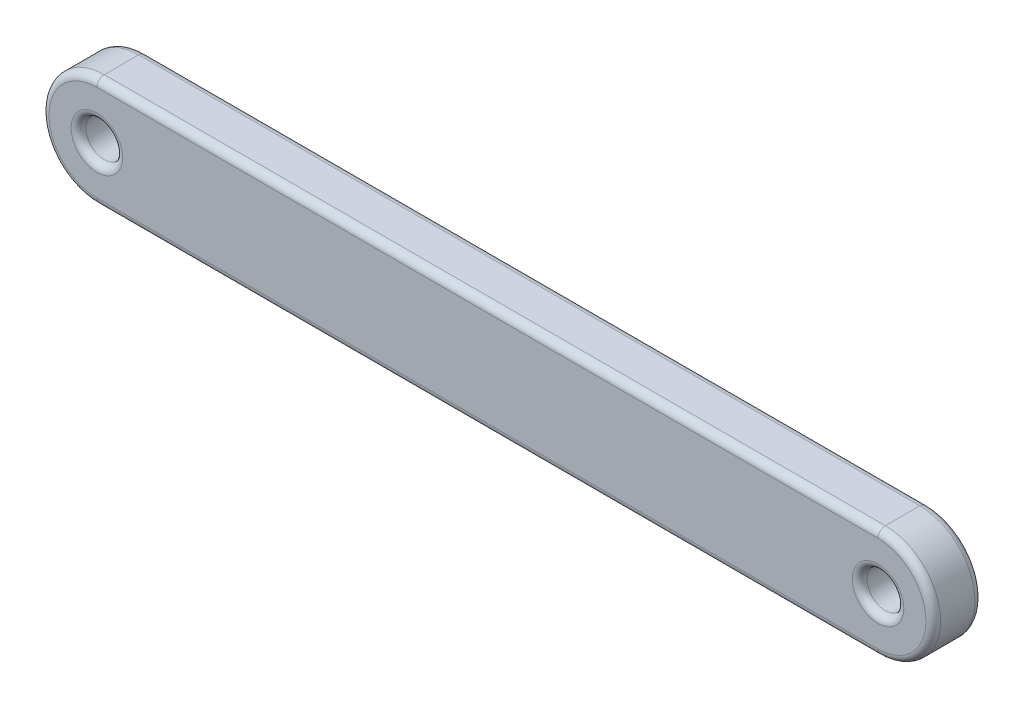
ISO-10303-21;
HEADER;
FILE_DESCRIPTION(('STEP AP214'),'2;1');
FILE_NAME('part.step','',(''),(''),'','','');
FILE_SCHEMA(('AUTOMOTIVE_DESIGN { 1 0 10303 214 1 1 1 1 }'));
ENDSEC;
DATA;
#1=APPLICATION_CONTEXT('core data for automotive mechanical design processes');
#2=APPLICATION_PROTOCOL_DEFINITION('international standard','automotive_design',2000,#1);
#3=PRODUCT_CONTEXT('',#1,'mechanical');
#4=PRODUCT('Part','Part','',(#3));
#5=PRODUCT_RELATED_PRODUCT_CATEGORY('part','',(#4));
#6=PRODUCT_DEFINITION_FORMATION('','',#4);
#7=PRODUCT_DEFINITION_CONTEXT('part definition',#1,'design');
#8=PRODUCT_DEFINITION('design','',#6,#7);
#9=PRODUCT_DEFINITION_SHAPE('','',#8);
#10=(LENGTH_UNIT() NAMED_UNIT(*) SI_UNIT(.MILLI.,.METRE.));
#11=(NAMED_UNIT(*) PLANE_ANGLE_UNIT() SI_UNIT($,.RADIAN.));
#12=(NAMED_UNIT(*) SI_UNIT($,.STERADIAN.) SOLID_ANGLE_UNIT());
#13=UNCERTAINTY_MEASURE_WITH_UNIT(LENGTH_MEASURE(1.E-05),#10,'distance_accuracy_value','');
#14=(GEOMETRIC_REPRESENTATION_CONTEXT(3) GLOBAL_UNCERTAINTY_ASSIGNED_CONTEXT((#13)) GLOBAL_UNIT_ASSIGNED_CONTEXT((#10,
#11,#12)) REPRESENTATION_CONTEXT('',''));
#15=CARTESIAN_POINT('',(0.,0.,0.));
#16=DIRECTION('',(0.,0.,1.));
#17=DIRECTION('',(1.,0.,0.));
#18=AXIS2_PLACEMENT_3D('',#15,#16,#17);
#19=CARTESIAN_POINT('',(0.,0.,2.));
#20=DIRECTION('',(0.,0.,1.));
#21=DIRECTION('',(1.,0.,0.));
#22=AXIS2_PLACEMENT_3D('',#19,#20,#21);
#23=PLANE('',#22);
#24=CARTESIAN_POINT('',(31.82825623,0.,2.));
#25=DIRECTION('',(0.,0.,1.));
#26=DIRECTION('',(1.,0.,0.));
#27=AXIS2_PLACEMENT_3D('',#24,#25,#26);
#28=CIRCLE('',#27,1.05);
#29=CARTESIAN_POINT('',(32.87825623,0.,2.));
#30=VERTEX_POINT('',#29);
#31=EDGE_CURVE('E11',#30,#30,#28,.F.);
#32=ORIENTED_EDGE('',*,*,#31,.T.);
#33=EDGE_LOOP('',(#32));
#34=FACE_BOUND('',#33,.T.);
#35=CARTESIAN_POINT('',(31.82825623,0.,2.));
#36=DIRECTION('',(0.,0.,1.));
#37=DIRECTION('',(1.,0.,0.));
#38=AXIS2_PLACEMENT_3D('',#35,#36,#37);
#39=CIRCLE('',#38,1.95);
#40=CARTESIAN_POINT('',(31.82825623,-1.95,2.));
#41=VERTEX_POINT('',#40);
#42=CARTESIAN_POINT('',(31.82825623,1.95,2.));
#43=VERTEX_POINT('',#42);
#44=EDGE_CURVE('E50',#41,#43,#39,.T.);
#45=ORIENTED_EDGE('',*,*,#44,.T.);
#46=DIRECTION('',(-1.,0.,0.));
#47=VECTOR('',#46,1.);
#48=CARTESIAN_POINT('',(0.,1.95,2.));
#49=LINE('',#48,#47);
#50=CARTESIAN_POINT('',(0.,1.95,2.));
#51=VERTEX_POINT('',#50);
#52=EDGE_CURVE('E42',#43,#51,#49,.T.);
#53=ORIENTED_EDGE('',*,*,#52,.T.);
#54=CARTESIAN_POINT('',(0.,0.,2.));
#55=DIRECTION('',(0.,0.,1.));
#56=DIRECTION('',(1.,0.,0.));
#57=AXIS2_PLACEMENT_3D('',#54,#55,#56);
#58=CIRCLE('',#57,1.95);
#59=CARTESIAN_POINT('',(0.,-1.95,2.));
#60=VERTEX_POINT('',#59);
#61=EDGE_CURVE('E168',#51,#60,#58,.T.);
#62=ORIENTED_EDGE('',*,*,#61,.T.);
#63=DIRECTION('',(1.,0.,0.));
#64=VECTOR('',#63,1.);
#65=CARTESIAN_POINT('',(31.82825623,-1.95,2.));
#66=LINE('',#65,#64);
#67=EDGE_CURVE('E55',#60,#41,#66,.T.);
#68=ORIENTED_EDGE('',*,*,#67,.T.);
#69=EDGE_LOOP('',(#45,#53,#62,#68));
#70=FACE_BOUND('',#69,.T.);
#71=CARTESIAN_POINT('',(0.,0.,2.));
#72=DIRECTION('',(0.,0.,1.));
#73=DIRECTION('',(1.,0.,0.));
#74=AXIS2_PLACEMENT_3D('',#71,#72,#73);
#75=CIRCLE('',#74,1.05);
#76=CARTESIAN_POINT('',(1.05,0.,2.));
#77=VERTEX_POINT('',#76);
#78=EDGE_CURVE('E165',#77,#77,#75,.F.);
#79=ORIENTED_EDGE('',*,*,#78,.T.);
#80=EDGE_LOOP('',(#79));
#81=FACE_BOUND('',#80,.T.);
#82=ADVANCED_FACE('F33',(#34,#70,#81),#23,.T.);
#83=CARTESIAN_POINT('',(0.,0.,0.));
#84=DIRECTION('',(0.,0.,1.));
#85=DIRECTION('',(1.,0.,0.));
#86=AXIS2_PLACEMENT_3D('',#83,#84,#85);
#87=PLANE('',#86);
#88=CARTESIAN_POINT('',(31.82825623,0.,0.));
#89=DIRECTION('',(0.,0.,1.));
#90=DIRECTION('',(1.,0.,0.));
#91=AXIS2_PLACEMENT_3D('',#88,#89,#90);
#92=CIRCLE('',#91,1.05);
#93=CARTESIAN_POINT('',(32.87825623,0.,0.));
#94=VERTEX_POINT('',#93);
#95=EDGE_CURVE('E130',#94,#94,#92,.T.);
#96=ORIENTED_EDGE('',*,*,#95,.T.);
#97=EDGE_LOOP('',(#96));
#98=FACE_BOUND('',#97,.T.);
#99=CARTESIAN_POINT('',(0.,0.,0.));
#100=DIRECTION('',(0.,0.,1.));
#101=DIRECTION('',(1.,0.,0.));
#102=AXIS2_PLACEMENT_3D('',#99,#100,#101);
#103=CIRCLE('',#102,1.05);
#104=CARTESIAN_POINT('',(1.05,0.,0.));
#105=VERTEX_POINT('',#104);
#106=EDGE_CURVE('E127',#105,#105,#103,.T.);
#107=ORIENTED_EDGE('',*,*,#106,.T.);
#108=EDGE_LOOP('',(#107));
#109=FACE_BOUND('',#108,.T.);
#110=CARTESIAN_POINT('',(31.82825623,0.,0.));
#111=DIRECTION('',(0.,0.,1.));
#112=DIRECTION('',(1.,0.,0.));
#113=AXIS2_PLACEMENT_3D('',#110,#111,#112);
#114=CIRCLE('',#113,1.95);
#115=CARTESIAN_POINT('',(31.82825623,1.95,0.));
#116=VERTEX_POINT('',#115);
#117=CARTESIAN_POINT('',(31.82825623,-1.95,0.));
#118=VERTEX_POINT('',#117);
#119=EDGE_CURVE('E126',#116,#118,#114,.F.);
#120=ORIENTED_EDGE('',*,*,#119,.T.);
#121=DIRECTION('',(1.,0.,0.));
#122=VECTOR('',#121,1.);
#123=CARTESIAN_POINT('',(0.,-1.95,0.));
#124=LINE('',#123,#122);
#125=CARTESIAN_POINT('',(0.,-1.95,0.));
#126=VERTEX_POINT('',#125);
#127=EDGE_CURVE('E105',#118,#126,#124,.F.);
#128=ORIENTED_EDGE('',*,*,#127,.T.);
#129=CARTESIAN_POINT('',(0.,0.,0.));
#130=DIRECTION('',(0.,0.,1.));
#131=DIRECTION('',(1.,0.,0.));
#132=AXIS2_PLACEMENT_3D('',#129,#130,#131);
#133=CIRCLE('',#132,1.95);
#134=CARTESIAN_POINT('',(0.,1.95,0.));
#135=VERTEX_POINT('',#134);
#136=EDGE_CURVE('E115',#126,#135,#133,.F.);
#137=ORIENTED_EDGE('',*,*,#136,.T.);
#138=DIRECTION('',(-1.,0.,0.));
#139=VECTOR('',#138,1.);
#140=CARTESIAN_POINT('',(0.,1.95,0.));
#141=LINE('',#140,#139);
#142=EDGE_CURVE('E121',#135,#116,#141,.F.);
#143=ORIENTED_EDGE('',*,*,#142,.T.);
#144=EDGE_LOOP('',(#120,#128,#137,#143));
#145=FACE_BOUND('',#144,.T.);
#146=ADVANCED_FACE('F124',(#98,#109,#145),#87,.F.);
#147=CARTESIAN_POINT('',(0.,0.,2.));
#148=DIRECTION('',(0.,0.,-1.));
#149=DIRECTION('',(-1.,0.,0.));
#150=AXIS2_PLACEMENT_3D('',#147,#148,#149);
#151=CYLINDRICAL_SURFACE('',#150,2.25);
#152=DIRECTION('',(0.,0.,-1.));
#153=VECTOR('',#152,1.);
#154=CARTESIAN_POINT('',(0.,2.25,2.));
#155=LINE('',#154,#153);
#156=CARTESIAN_POINT('',(0.,2.25,1.7));
#157=VERTEX_POINT('',#156);
#158=CARTESIAN_POINT('',(0.,2.25,0.3));
#159=VERTEX_POINT('',#158);
#160=EDGE_CURVE('E177',#157,#159,#155,.T.);
#161=ORIENTED_EDGE('',*,*,#160,.T.);
#162=CARTESIAN_POINT('',(0.,0.,0.3));
#163=DIRECTION('',(0.,0.,1.));
#164=DIRECTION('',(1.,0.,0.));
#165=AXIS2_PLACEMENT_3D('',#162,#163,#164);
#166=CIRCLE('',#165,2.25);
#167=CARTESIAN_POINT('',(0.,-2.25,0.3));
#168=VERTEX_POINT('',#167);
#169=EDGE_CURVE('E163',#159,#168,#166,.T.);
#170=ORIENTED_EDGE('',*,*,#169,.T.);
#171=DIRECTION('',(0.,0.,-1.));
#172=VECTOR('',#171,1.);
#173=CARTESIAN_POINT('',(0.,-2.25,2.));
#174=LINE('',#173,#172);
#175=CARTESIAN_POINT('',(0.,-2.25,1.7));
#176=VERTEX_POINT('',#175);
#177=EDGE_CURVE('E122',#176,#168,#174,.T.);
#178=ORIENTED_EDGE('',*,*,#177,.F.);
#179=CARTESIAN_POINT('',(0.,0.,1.7));
#180=DIRECTION('',(0.,0.,1.));
#181=DIRECTION('',(1.,0.,0.));
#182=AXIS2_PLACEMENT_3D('',#179,#180,#181);
#183=CIRCLE('',#182,2.25);
#184=EDGE_CURVE('E161',#176,#157,#183,.F.);
#185=ORIENTED_EDGE('',*,*,#184,.T.);
#186=EDGE_LOOP('',(#161,#170,#178,#185));
#187=FACE_BOUND('',#186,.T.);
#188=ADVANCED_FACE('F203',(#187),#151,.T.);
#189=CARTESIAN_POINT('',(0.,-2.25,2.));
#190=DIRECTION('',(0.,1.,0.));
#191=DIRECTION('',(0.,0.,1.));
#192=AXIS2_PLACEMENT_3D('',#189,#190,#191);
#193=PLANE('',#192);
#194=ORIENTED_EDGE('',*,*,#177,.T.);
#195=DIRECTION('',(1.,0.,0.));
#196=VECTOR('',#195,1.);
#197=CARTESIAN_POINT('',(0.,-2.25,0.3));
#198=LINE('',#197,#196);
#199=CARTESIAN_POINT('',(31.82825623,-2.25,0.3));
#200=VERTEX_POINT('',#199);
#201=EDGE_CURVE('E108',#168,#200,#198,.T.);
#202=ORIENTED_EDGE('',*,*,#201,.T.);
#203=DIRECTION('',(0.,0.,-1.));
#204=VECTOR('',#203,1.);
#205=CARTESIAN_POINT('',(31.82825623,-2.25,2.));
#206=LINE('',#205,#204);
#207=CARTESIAN_POINT('',(31.82825623,-2.25,1.7));
#208=VERTEX_POINT('',#207);
#209=EDGE_CURVE('E200',#208,#200,#206,.T.);
#210=ORIENTED_EDGE('',*,*,#209,.F.);
#211=DIRECTION('',(1.,0.,0.));
#212=VECTOR('',#211,1.);
#213=CARTESIAN_POINT('',(0.,-2.25,1.7));
#214=LINE('',#213,#212);
#215=EDGE_CURVE('E149',#208,#176,#214,.F.);
#216=ORIENTED_EDGE('',*,*,#215,.T.);
#217=EDGE_LOOP('',(#194,#202,#210,#216));
#218=FACE_BOUND('',#217,.T.);
#219=ADVANCED_FACE('F198',(#218),#193,.F.);
#220=CARTESIAN_POINT('',(31.82825623,0.,2.));
#221=DIRECTION('',(0.,0.,-1.));
#222=DIRECTION('',(-1.,0.,0.));
#223=AXIS2_PLACEMENT_3D('',#220,#221,#222);
#224=CYLINDRICAL_SURFACE('',#223,2.25);
#225=ORIENTED_EDGE('',*,*,#209,.T.);
#226=CARTESIAN_POINT('',(31.82825623,0.,0.3));
#227=DIRECTION('',(0.,0.,1.));
#228=DIRECTION('',(1.,0.,0.));
#229=AXIS2_PLACEMENT_3D('',#226,#227,#228);
#230=CIRCLE('',#229,2.25);
#231=CARTESIAN_POINT('',(31.82825623,2.25,0.3));
#232=VERTEX_POINT('',#231);
#233=EDGE_CURVE('E154',#200,#232,#230,.T.);
#234=ORIENTED_EDGE('',*,*,#233,.T.);
#235=DIRECTION('',(0.,0.,-1.));
#236=VECTOR('',#235,1.);
#237=CARTESIAN_POINT('',(31.82825623,2.25,2.));
#238=LINE('',#237,#236);
#239=CARTESIAN_POINT('',(31.82825623,2.25,1.7));
#240=VERTEX_POINT('',#239);
#241=EDGE_CURVE('E206',#240,#232,#238,.T.);
#242=ORIENTED_EDGE('',*,*,#241,.F.);
#243=CARTESIAN_POINT('',(31.82825623,0.,1.7));
#244=DIRECTION('',(0.,0.,1.));
#245=DIRECTION('',(1.,0.,0.));
#246=AXIS2_PLACEMENT_3D('',#243,#244,#245);
#247=CIRCLE('',#246,2.25);
#248=EDGE_CURVE('E152',#240,#208,#247,.F.);
#249=ORIENTED_EDGE('',*,*,#248,.T.);
#250=EDGE_LOOP('',(#225,#234,#242,#249));
#251=FACE_BOUND('',#250,.T.);
#252=ADVANCED_FACE('F219',(#251),#224,.T.);
#253=CARTESIAN_POINT('',(0.,2.25,2.));
#254=DIRECTION('',(0.,-1.,0.));
#255=DIRECTION('',(0.,0.,-1.));
#256=AXIS2_PLACEMENT_3D('',#253,#254,#255);
#257=PLANE('',#256);
#258=ORIENTED_EDGE('',*,*,#241,.T.);
#259=DIRECTION('',(-1.,0.,0.));
#260=VECTOR('',#259,1.);
#261=CARTESIAN_POINT('',(0.,2.25,0.3));
#262=LINE('',#261,#260);
#263=EDGE_CURVE('E159',#232,#159,#262,.T.);
#264=ORIENTED_EDGE('',*,*,#263,.T.);
#265=ORIENTED_EDGE('',*,*,#160,.F.);
#266=DIRECTION('',(-1.,0.,0.));
#267=VECTOR('',#266,1.);
#268=CARTESIAN_POINT('',(31.82825623,2.25,1.7));
#269=LINE('',#268,#267);
#270=EDGE_CURVE('E156',#157,#240,#269,.F.);
#271=ORIENTED_EDGE('',*,*,#270,.T.);
#272=EDGE_LOOP('',(#258,#264,#265,#271));
#273=FACE_BOUND('',#272,.T.);
#274=ADVANCED_FACE('F223',(#273),#257,.F.);
#275=CARTESIAN_POINT('',(0.,0.,2.));
#276=DIRECTION('',(0.,0.,-1.));
#277=DIRECTION('',(-1.,0.,0.));
#278=AXIS2_PLACEMENT_3D('',#275,#276,#277);
#279=CYLINDRICAL_SURFACE('',#278,0.75);
#280=CARTESIAN_POINT('',(0.,0.,0.3));
#281=DIRECTION('',(0.,0.,1.));
#282=DIRECTION('',(1.,0.,0.));
#283=AXIS2_PLACEMENT_3D('',#280,#281,#282);
#284=CIRCLE('',#283,0.75);
#285=CARTESIAN_POINT('',(0.75,0.,0.3));
#286=VERTEX_POINT('',#285);
#287=EDGE_CURVE('E146',#286,#286,#284,.F.);
#288=ORIENTED_EDGE('',*,*,#287,.T.);
#289=EDGE_LOOP('',(#288));
#290=FACE_BOUND('',#289,.T.);
#291=CARTESIAN_POINT('',(0.,0.,1.7));
#292=DIRECTION('',(0.,0.,1.));
#293=DIRECTION('',(1.,0.,0.));
#294=AXIS2_PLACEMENT_3D('',#291,#292,#293);
#295=CIRCLE('',#294,0.75);
#296=CARTESIAN_POINT('',(0.75,0.,1.7));
#297=VERTEX_POINT('',#296);
#298=EDGE_CURVE('E143',#297,#297,#295,.T.);
#299=ORIENTED_EDGE('',*,*,#298,.T.);
#300=EDGE_LOOP('',(#299));
#301=FACE_BOUND('',#300,.T.);
#302=ADVANCED_FACE('F239',(#290,#301),#279,.F.);
#303=CARTESIAN_POINT('',(31.82825623,0.,2.));
#304=DIRECTION('',(0.,0.,-1.));
#305=DIRECTION('',(-1.,0.,0.));
#306=AXIS2_PLACEMENT_3D('',#303,#304,#305);
#307=CYLINDRICAL_SURFACE('',#306,0.749999999999999);
#308=CARTESIAN_POINT('',(31.82825623,0.,0.3));
#309=DIRECTION('',(0.,0.,1.));
#310=DIRECTION('',(1.,0.,0.));
#311=AXIS2_PLACEMENT_3D('',#308,#309,#310);
#312=CIRCLE('',#311,0.749999999999999);
#313=CARTESIAN_POINT('',(32.57825623,0.,0.3));
#314=VERTEX_POINT('',#313);
#315=EDGE_CURVE('E140',#314,#314,#312,.F.);
#316=ORIENTED_EDGE('',*,*,#315,.T.);
#317=EDGE_LOOP('',(#316));
#318=FACE_BOUND('',#317,.T.);
#319=CARTESIAN_POINT('',(31.82825623,0.,1.7));
#320=DIRECTION('',(0.,0.,1.));
#321=DIRECTION('',(1.,0.,0.));
#322=AXIS2_PLACEMENT_3D('',#319,#320,#321);
#323=CIRCLE('',#322,0.749999999999999);
#324=CARTESIAN_POINT('',(32.57825623,0.,1.7));
#325=VERTEX_POINT('',#324);
#326=EDGE_CURVE('E137',#325,#325,#323,.T.);
#327=ORIENTED_EDGE('',*,*,#326,.T.);
#328=EDGE_LOOP('',(#327));
#329=FACE_BOUND('',#328,.T.);
#330=ADVANCED_FACE('F241',(#318,#329),#307,.F.);
#331=CARTESIAN_POINT('',(31.82825623,0.,0.3));
#332=DIRECTION('',(0.,0.,1.));
#333=DIRECTION('',(1.,0.,0.));
#334=AXIS2_PLACEMENT_3D('',#331,#332,#333);
#335=TOROIDAL_SURFACE('',#334,1.05,0.3);
#336=ORIENTED_EDGE('',*,*,#315,.F.);
#337=EDGE_LOOP('',(#336));
#338=FACE_BOUND('',#337,.T.);
#339=ORIENTED_EDGE('',*,*,#95,.F.);
#340=EDGE_LOOP('',(#339));
#341=FACE_BOUND('',#340,.T.);
#342=ADVANCED_FACE('F248',(#338,#341),#335,.T.);
#343=CARTESIAN_POINT('',(0.,0.,0.3));
#344=DIRECTION('',(0.,0.,1.));
#345=DIRECTION('',(1.,0.,0.));
#346=AXIS2_PLACEMENT_3D('',#343,#344,#345);
#347=TOROIDAL_SURFACE('',#346,1.05,0.3);
#348=ORIENTED_EDGE('',*,*,#287,.F.);
#349=EDGE_LOOP('',(#348));
#350=FACE_BOUND('',#349,.T.);
#351=ORIENTED_EDGE('',*,*,#106,.F.);
#352=EDGE_LOOP('',(#351));
#353=FACE_BOUND('',#352,.T.);
#354=ADVANCED_FACE('F264',(#350,#353),#347,.T.);
#355=CARTESIAN_POINT('',(0.,1.95,0.3));
#356=DIRECTION('',(-1.,0.,0.));
#357=DIRECTION('',(0.,0.,1.));
#358=AXIS2_PLACEMENT_3D('',#355,#356,#357);
#359=CYLINDRICAL_SURFACE('',#358,0.3);
#360=CARTESIAN_POINT('',(31.82825623,1.95,0.3));
#361=DIRECTION('',(1.,0.,0.));
#362=DIRECTION('',(0.,0.,-1.));
#363=AXIS2_PLACEMENT_3D('',#360,#361,#362);
#364=CIRCLE('',#363,0.3);
#365=EDGE_CURVE('E111',#116,#232,#364,.T.);
#366=ORIENTED_EDGE('',*,*,#365,.F.);
#367=ORIENTED_EDGE('',*,*,#142,.F.);
#368=CARTESIAN_POINT('',(0.,1.95,0.3));
#369=DIRECTION('',(-1.,0.,0.));
#370=DIRECTION('',(0.,0.,1.));
#371=AXIS2_PLACEMENT_3D('',#368,#369,#370);
#372=CIRCLE('',#371,0.3);
#373=EDGE_CURVE('E118',#159,#135,#372,.T.);
#374=ORIENTED_EDGE('',*,*,#373,.F.);
#375=ORIENTED_EDGE('',*,*,#263,.F.);
#376=EDGE_LOOP('',(#366,#367,#374,#375));
#377=FACE_BOUND('',#376,.T.);
#378=ADVANCED_FACE('F212',(#377),#359,.T.);
#379=CARTESIAN_POINT('',(0.,0.,0.3));
#380=DIRECTION('',(0.,0.,1.));
#381=DIRECTION('',(1.,0.,0.));
#382=AXIS2_PLACEMENT_3D('',#379,#380,#381);
#383=TOROIDAL_SURFACE('',#382,1.95,0.3);
#384=ORIENTED_EDGE('',*,*,#373,.T.);
#385=ORIENTED_EDGE('',*,*,#136,.F.);
#386=CARTESIAN_POINT('',(0.,-1.95,0.3));
#387=DIRECTION('',(1.,0.,0.));
#388=DIRECTION('',(0.,0.,-1.));
#389=AXIS2_PLACEMENT_3D('',#386,#387,#388);
#390=CIRCLE('',#389,0.3);
#391=EDGE_CURVE('E101',#168,#126,#390,.T.);
#392=ORIENTED_EDGE('',*,*,#391,.F.);
#393=ORIENTED_EDGE('',*,*,#169,.F.);
#394=EDGE_LOOP('',(#384,#385,#392,#393));
#395=FACE_BOUND('',#394,.T.);
#396=ADVANCED_FACE('F116',(#395),#383,.T.);
#397=CARTESIAN_POINT('',(31.82825623,0.,0.3));
#398=DIRECTION('',(0.,0.,1.));
#399=DIRECTION('',(1.,0.,0.));
#400=AXIS2_PLACEMENT_3D('',#397,#398,#399);
#401=TOROIDAL_SURFACE('',#400,1.95,0.3);
#402=ORIENTED_EDGE('',*,*,#365,.T.);
#403=ORIENTED_EDGE('',*,*,#233,.F.);
#404=CARTESIAN_POINT('',(31.82825623,-1.95,0.3));
#405=DIRECTION('',(-1.,0.,0.));
#406=DIRECTION('',(0.,0.,1.));
#407=AXIS2_PLACEMENT_3D('',#404,#405,#406);
#408=CIRCLE('',#407,0.3);
#409=EDGE_CURVE('E112',#118,#200,#408,.T.);
#410=ORIENTED_EDGE('',*,*,#409,.F.);
#411=ORIENTED_EDGE('',*,*,#119,.F.);
#412=EDGE_LOOP('',(#402,#403,#410,#411));
#413=FACE_BOUND('',#412,.T.);
#414=ADVANCED_FACE('F215',(#413),#401,.T.);
#415=CARTESIAN_POINT('',(0.,-1.95,0.3));
#416=DIRECTION('',(1.,0.,0.));
#417=DIRECTION('',(0.,0.,-1.));
#418=AXIS2_PLACEMENT_3D('',#415,#416,#417);
#419=CYLINDRICAL_SURFACE('',#418,0.3);
#420=ORIENTED_EDGE('',*,*,#391,.T.);
#421=ORIENTED_EDGE('',*,*,#127,.F.);
#422=ORIENTED_EDGE('',*,*,#409,.T.);
#423=ORIENTED_EDGE('',*,*,#201,.F.);
#424=EDGE_LOOP('',(#420,#421,#422,#423));
#425=FACE_BOUND('',#424,.T.);
#426=ADVANCED_FACE('F103',(#425),#419,.T.);
#427=CARTESIAN_POINT('',(31.82825623,0.,1.7));
#428=DIRECTION('',(0.,0.,1.));
#429=DIRECTION('',(1.,0.,0.));
#430=AXIS2_PLACEMENT_3D('',#427,#428,#429);
#431=TOROIDAL_SURFACE('',#430,1.05,0.3);
#432=ORIENTED_EDGE('',*,*,#31,.F.);
#433=EDGE_LOOP('',(#432));
#434=FACE_BOUND('',#433,.T.);
#435=ORIENTED_EDGE('',*,*,#326,.F.);
#436=EDGE_LOOP('',(#435));
#437=FACE_BOUND('',#436,.T.);
#438=ADVANCED_FACE('F271',(#434,#437),#431,.T.);
#439=CARTESIAN_POINT('',(0.,-1.95,1.7));
#440=DIRECTION('',(-1.,0.,0.));
#441=DIRECTION('',(0.,0.,1.));
#442=AXIS2_PLACEMENT_3D('',#439,#440,#441);
#443=CYLINDRICAL_SURFACE('',#442,0.3);
#444=CARTESIAN_POINT('',(0.,-1.95,1.7));
#445=DIRECTION('',(-1.,0.,0.));
#446=DIRECTION('',(0.,0.,1.));
#447=AXIS2_PLACEMENT_3D('',#444,#445,#446);
#448=CIRCLE('',#447,0.3);
#449=EDGE_CURVE('E181',#176,#60,#448,.T.);
#450=ORIENTED_EDGE('',*,*,#449,.F.);
#451=ORIENTED_EDGE('',*,*,#215,.F.);
#452=CARTESIAN_POINT('',(31.82825623,-1.95,1.7));
#453=DIRECTION('',(1.,0.,0.));
#454=DIRECTION('',(0.,0.,-1.));
#455=AXIS2_PLACEMENT_3D('',#452,#453,#454);
#456=CIRCLE('',#455,0.3);
#457=EDGE_CURVE('E37',#41,#208,#456,.T.);
#458=ORIENTED_EDGE('',*,*,#457,.F.);
#459=ORIENTED_EDGE('',*,*,#67,.F.);
#460=EDGE_LOOP('',(#450,#451,#458,#459));
#461=FACE_BOUND('',#460,.T.);
#462=ADVANCED_FACE('F193',(#461),#443,.T.);
#463=CARTESIAN_POINT('',(31.82825623,0.,1.7));
#464=DIRECTION('',(0.,0.,1.));
#465=DIRECTION('',(1.,0.,0.));
#466=AXIS2_PLACEMENT_3D('',#463,#464,#465);
#467=TOROIDAL_SURFACE('',#466,1.95,0.3);
#468=ORIENTED_EDGE('',*,*,#457,.T.);
#469=ORIENTED_EDGE('',*,*,#248,.F.);
#470=CARTESIAN_POINT('',(31.82825623,1.95,1.7));
#471=DIRECTION('',(-1.,0.,0.));
#472=DIRECTION('',(0.,0.,1.));
#473=AXIS2_PLACEMENT_3D('',#470,#471,#472);
#474=CIRCLE('',#473,0.3);
#475=EDGE_CURVE('E180',#43,#240,#474,.T.);
#476=ORIENTED_EDGE('',*,*,#475,.F.);
#477=ORIENTED_EDGE('',*,*,#44,.F.);
#478=EDGE_LOOP('',(#468,#469,#476,#477));
#479=FACE_BOUND('',#478,.T.);
#480=ADVANCED_FACE('F190',(#479),#467,.T.);
#481=CARTESIAN_POINT('',(0.,0.,1.7));
#482=DIRECTION('',(0.,0.,1.));
#483=DIRECTION('',(1.,0.,0.));
#484=AXIS2_PLACEMENT_3D('',#481,#482,#483);
#485=TOROIDAL_SURFACE('',#484,1.95,0.3);
#486=ORIENTED_EDGE('',*,*,#449,.T.);
#487=ORIENTED_EDGE('',*,*,#61,.F.);
#488=CARTESIAN_POINT('',(0.,1.95,1.7));
#489=DIRECTION('',(1.,0.,0.));
#490=DIRECTION('',(0.,0.,-1.));
#491=AXIS2_PLACEMENT_3D('',#488,#489,#490);
#492=CIRCLE('',#491,0.3);
#493=EDGE_CURVE('E178',#157,#51,#492,.T.);
#494=ORIENTED_EDGE('',*,*,#493,.F.);
#495=ORIENTED_EDGE('',*,*,#184,.F.);
#496=EDGE_LOOP('',(#486,#487,#494,#495));
#497=FACE_BOUND('',#496,.T.);
#498=ADVANCED_FACE('F228',(#497),#485,.T.);
#499=CARTESIAN_POINT('',(0.,1.95,1.7));
#500=DIRECTION('',(1.,0.,0.));
#501=DIRECTION('',(0.,0.,-1.));
#502=AXIS2_PLACEMENT_3D('',#499,#500,#501);
#503=CYLINDRICAL_SURFACE('',#502,0.3);
#504=ORIENTED_EDGE('',*,*,#475,.T.);
#505=ORIENTED_EDGE('',*,*,#270,.F.);
#506=ORIENTED_EDGE('',*,*,#493,.T.);
#507=ORIENTED_EDGE('',*,*,#52,.F.);
#508=EDGE_LOOP('',(#504,#505,#506,#507));
#509=FACE_BOUND('',#508,.T.);
#510=ADVANCED_FACE('F226',(#509),#503,.T.);
#511=CARTESIAN_POINT('',(0.,0.,1.7));
#512=DIRECTION('',(0.,0.,1.));
#513=DIRECTION('',(1.,0.,0.));
#514=AXIS2_PLACEMENT_3D('',#511,#512,#513);
#515=TOROIDAL_SURFACE('',#514,1.05,0.3);
#516=ORIENTED_EDGE('',*,*,#78,.F.);
#517=EDGE_LOOP('',(#516));
#518=FACE_BOUND('',#517,.T.);
#519=ORIENTED_EDGE('',*,*,#298,.F.);
#520=EDGE_LOOP('',(#519));
#521=FACE_BOUND('',#520,.T.);
#522=ADVANCED_FACE('F35',(#518,#521),#515,.T.);
#523=CLOSED_SHELL('',(#82,#146,#188,#219,#252,#274,#302,#330,#342,#354,#378,#396,#414,#426,#438,
#462,#480,#498,#510,#522));
#524=MANIFOLD_SOLID_BREP('B2',#523);
#525=ADVANCED_BREP_SHAPE_REPRESENTATION('',(#18,#524),#14);
#526=SHAPE_DEFINITION_REPRESENTATION(#9,#525);
ENDSEC;
END-ISO-10303-21;
